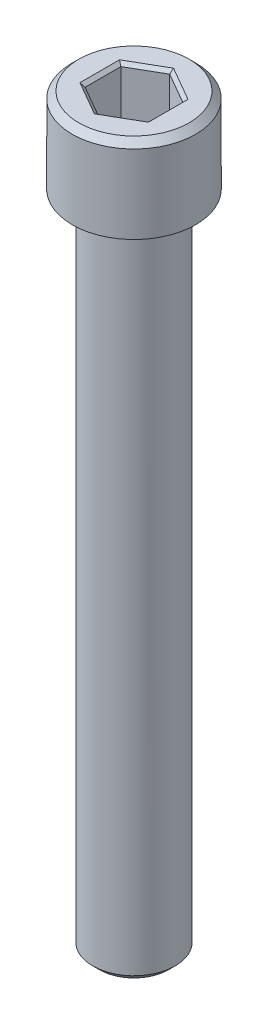
ISO-10303-21;
HEADER;
FILE_DESCRIPTION(('STEP AP214'),'2;1');
FILE_NAME('part.step','',(''),(''),'','','');
FILE_SCHEMA(('AUTOMOTIVE_DESIGN { 1 0 10303 214 1 1 1 1 }'));
ENDSEC;
DATA;
#1=APPLICATION_CONTEXT('core data for automotive mechanical design processes');
#2=APPLICATION_PROTOCOL_DEFINITION('international standard','automotive_design',2000,#1);
#3=PRODUCT_CONTEXT('',#1,'mechanical');
#4=PRODUCT('Part','Part','',(#3));
#5=PRODUCT_RELATED_PRODUCT_CATEGORY('part','',(#4));
#6=PRODUCT_DEFINITION_FORMATION('','',#4);
#7=PRODUCT_DEFINITION_CONTEXT('part definition',#1,'design');
#8=PRODUCT_DEFINITION('design','',#6,#7);
#9=PRODUCT_DEFINITION_SHAPE('','',#8);
#10=(LENGTH_UNIT() NAMED_UNIT(*) SI_UNIT(.MILLI.,.METRE.));
#11=(NAMED_UNIT(*) PLANE_ANGLE_UNIT() SI_UNIT($,.RADIAN.));
#12=(NAMED_UNIT(*) SI_UNIT($,.STERADIAN.) SOLID_ANGLE_UNIT());
#13=UNCERTAINTY_MEASURE_WITH_UNIT(LENGTH_MEASURE(1.E-05),#10,'distance_accuracy_value','');
#14=(GEOMETRIC_REPRESENTATION_CONTEXT(3) GLOBAL_UNCERTAINTY_ASSIGNED_CONTEXT((#13)) GLOBAL_UNIT_ASSIGNED_CONTEXT((#10,
#11,#12)) REPRESENTATION_CONTEXT('',''));
#15=CARTESIAN_POINT('',(0.,0.,0.));
#16=DIRECTION('',(0.,0.,1.));
#17=DIRECTION('',(1.,0.,0.));
#18=AXIS2_PLACEMENT_3D('',#15,#16,#17);
#19=CARTESIAN_POINT('',(0.,-4.57199999987097,0.));
#20=DIRECTION('',(0.,-1.,0.));
#21=DIRECTION('',(0.,0.,-1.));
#22=AXIS2_PLACEMENT_3D('',#19,#20,#21);
#23=PLANE('',#22);
#24=DIRECTION('',(-0.866025403798195,0.,0.499999999976173));
#25=VECTOR('',#24,1.);
#26=CARTESIAN_POINT('',(1.19380000002816,-4.572,2.06772225425588));
#27=LINE('',#26,#25);
#28=CARTESIAN_POINT('',(0.,-4.57199999993548,2.75696300537009));
#29=VERTEX_POINT('',#28);
#30=CARTESIAN_POINT('',(2.38759999998049,-4.57199999993548,1.37848150275658));
#31=VERTEX_POINT('',#30);
#32=EDGE_CURVE('E187',#29,#31,#27,.F.);
#33=ORIENTED_EDGE('',*,*,#32,.T.);
#34=DIRECTION('',(0.,0.,1.));
#35=VECTOR('',#34,1.);
#36=CARTESIAN_POINT('',(2.38760000028387,-4.572,0.));
#37=LINE('',#36,#35);
#38=CARTESIAN_POINT('',(2.38759999990537,-4.57199999993548,-1.37848150291712));
#39=VERTEX_POINT('',#38);
#40=EDGE_CURVE('E104',#31,#39,#37,.F.);
#41=ORIENTED_EDGE('',*,*,#40,.T.);
#42=DIRECTION('',(0.866025403798195,0.,0.499999999976173));
#43=VECTOR('',#42,1.);
#44=CARTESIAN_POINT('',(1.19380000002816,-4.572,-2.06772225425588));
#45=LINE('',#44,#43);
#46=CARTESIAN_POINT('',(-1.09766188326745E-10,-4.57199999993548,-2.75696300537009));
#47=VERTEX_POINT('',#46);
#48=EDGE_CURVE('E100',#39,#47,#45,.F.);
#49=ORIENTED_EDGE('',*,*,#48,.T.);
#50=DIRECTION('',(0.866025403798195,0.,-0.499999999976173));
#51=VECTOR('',#50,1.);
#52=CARTESIAN_POINT('',(-1.19380000002816,-4.572,-2.06772225425588));
#53=LINE('',#52,#51);
#54=CARTESIAN_POINT('',(-2.38759999998049,-4.57199999993548,-1.37848150275658));
#55=VERTEX_POINT('',#54);
#56=EDGE_CURVE('E91',#47,#55,#53,.F.);
#57=ORIENTED_EDGE('',*,*,#56,.T.);
#58=DIRECTION('',(0.,0.,-1.));
#59=VECTOR('',#58,1.);
#60=CARTESIAN_POINT('',(-2.38760000028387,-4.572,0.));
#61=LINE('',#60,#59);
#62=CARTESIAN_POINT('',(-2.38759999990537,-4.57199999993548,1.37848150291712));
#63=VERTEX_POINT('',#62);
#64=EDGE_CURVE('E86',#55,#63,#61,.F.);
#65=ORIENTED_EDGE('',*,*,#64,.T.);
#66=DIRECTION('',(-0.866025403798195,0.,-0.499999999976173));
#67=VECTOR('',#66,1.);
#68=CARTESIAN_POINT('',(-1.19380000002816,-4.572,2.06772225425588));
#69=LINE('',#68,#67);
#70=EDGE_CURVE('E191',#63,#29,#69,.F.);
#71=ORIENTED_EDGE('',*,*,#70,.T.);
#72=EDGE_LOOP('',(#33,#41,#49,#57,#65,#71));
#73=FACE_BOUND('',#72,.T.);
#74=ADVANCED_FACE('F17',(#73),#23,.F.);
#75=CARTESIAN_POINT('',(1.19380000002816,0.,-2.06772225425588));
#76=DIRECTION('',(-0.499999999976173,0.,0.866025403798195));
#77=DIRECTION('',(0.866025403798195,0.,0.499999999976173));
#78=AXIS2_PLACEMENT_3D('',#75,#76,#77);
#79=PLANE('',#78);
#80=DIRECTION('',(-0.866025403771631,-1.12605364376169E-10,-0.500000000022183));
#81=VECTOR('',#80,1.);
#82=CARTESIAN_POINT('',(2.38759999971589,-0.25399999993977,-1.37848150282184));
#83=LINE('',#82,#81);
#84=CARTESIAN_POINT('',(2.38759999998106,-0.254000000015281,-1.37848150296289));
#85=VERTEX_POINT('',#84);
#86=CARTESIAN_POINT('',(-4.77588435349632E-12,-0.254000000085992,-2.75696300551199));
#87=VERTEX_POINT('',#86);
#88=EDGE_CURVE('E110',#85,#87,#83,.T.);
#89=ORIENTED_EDGE('',*,*,#88,.T.);
#90=DIRECTION('',(0.,1.,0.));
#91=VECTOR('',#90,1.);
#92=CARTESIAN_POINT('',(-2.44303709207028E-10,0.,-2.75696300544587));
#93=LINE('',#92,#91);
#94=EDGE_CURVE('E96',#87,#47,#93,.F.);
#95=ORIENTED_EDGE('',*,*,#94,.T.);
#96=ORIENTED_EDGE('',*,*,#48,.F.);
#97=DIRECTION('',(0.,1.,0.));
#98=VECTOR('',#97,1.);
#99=CARTESIAN_POINT('',(2.38760000028387,0.,-1.378481502874));
#100=LINE('',#99,#98);
#101=EDGE_CURVE('E181',#39,#85,#100,.T.);
#102=ORIENTED_EDGE('',*,*,#101,.T.);
#103=EDGE_LOOP('',(#89,#95,#96,#102));
#104=FACE_BOUND('',#103,.T.);
#105=ADVANCED_FACE('F109',(#104),#79,.T.);
#106=CARTESIAN_POINT('',(-1.19380000002816,0.,-2.06772225425588));
#107=DIRECTION('',(0.499999999976173,0.,0.866025403798195));
#108=DIRECTION('',(0.866025403798195,0.,-0.499999999976173));
#109=AXIS2_PLACEMENT_3D('',#106,#107,#108);
#110=PLANE('',#109);
#111=DIRECTION('',(-0.866025403751825,7.29934061873727E-11,0.500000000056488));
#112=VECTOR('',#111,1.);
#113=CARTESIAN_POINT('',(-2.19194454254001E-10,-0.254000000187495,-2.75696300540238));
#114=LINE('',#113,#112);
#115=CARTESIAN_POINT('',(-2.38760000016596,-0.254000000021092,-1.37848150274502));
#116=VERTEX_POINT('',#115);
#117=EDGE_CURVE('E172',#87,#116,#114,.T.);
#118=ORIENTED_EDGE('',*,*,#117,.T.);
#119=DIRECTION('',(0.,1.,0.));
#120=VECTOR('',#119,1.);
#121=CARTESIAN_POINT('',(-2.38760000028387,0.,-1.37848150262));
#122=LINE('',#121,#120);
#123=EDGE_CURVE('E98',#116,#55,#122,.F.);
#124=ORIENTED_EDGE('',*,*,#123,.T.);
#125=ORIENTED_EDGE('',*,*,#56,.F.);
#126=ORIENTED_EDGE('',*,*,#94,.F.);
#127=EDGE_LOOP('',(#118,#124,#125,#126));
#128=FACE_BOUND('',#127,.T.);
#129=ADVANCED_FACE('F94',(#128),#110,.T.);
#130=CARTESIAN_POINT('',(-2.38760000028387,0.,0.));
#131=DIRECTION('',(1.,0.,0.));
#132=DIRECTION('',(0.,0.,-1.));
#133=AXIS2_PLACEMENT_3D('',#130,#131,#132);
#134=PLANE('',#133);
#135=DIRECTION('',(0.,0.,1.));
#136=VECTOR('',#135,1.);
#137=CARTESIAN_POINT('',(-2.38760000018248,-0.254000000182478,0.));
#138=LINE('',#137,#136);
#139=CARTESIAN_POINT('',(-2.38760000009063,-0.254000000015281,1.37848150291977));
#140=VERTEX_POINT('',#139);
#141=EDGE_CURVE('E169',#116,#140,#138,.T.);
#142=ORIENTED_EDGE('',*,*,#141,.T.);
#143=DIRECTION('',(0.,1.,0.));
#144=VECTOR('',#143,1.);
#145=CARTESIAN_POINT('',(-2.38759999984559,0.,1.3784815030465));
#146=LINE('',#145,#144);
#147=EDGE_CURVE('E189',#140,#63,#146,.F.);
#148=ORIENTED_EDGE('',*,*,#147,.T.);
#149=ORIENTED_EDGE('',*,*,#64,.F.);
#150=ORIENTED_EDGE('',*,*,#123,.F.);
#151=EDGE_LOOP('',(#142,#148,#149,#150));
#152=FACE_BOUND('',#151,.T.);
#153=ADVANCED_FACE('F217',(#152),#134,.T.);
#154=CARTESIAN_POINT('',(-1.19380000002816,0.,2.06772225425588));
#155=DIRECTION('',(0.499999999976173,0.,-0.866025403798195));
#156=DIRECTION('',(-0.866025403798195,0.,-0.499999999976173));
#157=AXIS2_PLACEMENT_3D('',#154,#155,#156);
#158=PLANE('',#157);
#159=DIRECTION('',(0.866025403765944,-1.01229897824031E-10,0.500000000032035));
#160=VECTOR('',#159,1.);
#161=CARTESIAN_POINT('',(-2.38759999971589,-0.25399999993977,1.37848150282184));
#162=LINE('',#161,#160);
#163=CARTESIAN_POINT('',(-8.14689911288454E-11,-0.254000000082071,2.75696300548031));
#164=VERTEX_POINT('',#163);
#165=EDGE_CURVE('E163',#140,#164,#162,.T.);
#166=ORIENTED_EDGE('',*,*,#165,.T.);
#167=DIRECTION('',(0.,1.,0.));
#168=VECTOR('',#167,1.);
#169=CARTESIAN_POINT('',(1.50218162561777E-10,0.,2.75696300550019));
#170=LINE('',#169,#168);
#171=EDGE_CURVE('E184',#164,#29,#170,.F.);
#172=ORIENTED_EDGE('',*,*,#171,.T.);
#173=ORIENTED_EDGE('',*,*,#70,.F.);
#174=ORIENTED_EDGE('',*,*,#147,.F.);
#175=EDGE_LOOP('',(#166,#172,#173,#174));
#176=FACE_BOUND('',#175,.T.);
#177=ADVANCED_FACE('F194',(#176),#158,.T.);
#178=CARTESIAN_POINT('',(1.19380000002816,0.,2.06772225425588));
#179=DIRECTION('',(-0.499999999976173,0.,-0.866025403798195));
#180=DIRECTION('',(-0.866025403798195,0.,0.499999999976173));
#181=AXIS2_PLACEMENT_3D('',#178,#179,#180);
#182=PLANE('',#181);
#183=DIRECTION('',(0.866025403757513,8.43688137506995E-11,-0.500000000046637));
#184=VECTOR('',#183,1.);
#185=CARTESIAN_POINT('',(1.0942820000831E-10,-0.254000000218857,2.75696300542954));
#186=LINE('',#185,#184);
#187=CARTESIAN_POINT('',(2.38760000012961,-0.254000000019374,1.37848150274353));
#188=VERTEX_POINT('',#187);
#189=EDGE_CURVE('E154',#164,#188,#186,.T.);
#190=ORIENTED_EDGE('',*,*,#189,.T.);
#191=DIRECTION('',(0.,1.,0.));
#192=VECTOR('',#191,1.);
#193=CARTESIAN_POINT('',(2.38760000028387,0.,1.37848150262));
#194=LINE('',#193,#192);
#195=EDGE_CURVE('E178',#188,#31,#194,.F.);
#196=ORIENTED_EDGE('',*,*,#195,.T.);
#197=ORIENTED_EDGE('',*,*,#32,.F.);
#198=ORIENTED_EDGE('',*,*,#171,.F.);
#199=EDGE_LOOP('',(#190,#196,#197,#198));
#200=FACE_BOUND('',#199,.T.);
#201=ADVANCED_FACE('F198',(#200),#182,.T.);
#202=CARTESIAN_POINT('',(2.38760000028387,0.,0.));
#203=DIRECTION('',(-1.,0.,0.));
#204=DIRECTION('',(0.,0.,1.));
#205=AXIS2_PLACEMENT_3D('',#202,#203,#204);
#206=PLANE('',#205);
#207=DIRECTION('',(0.,0.,1.));
#208=VECTOR('',#207,1.);
#209=CARTESIAN_POINT('',(2.38760000018248,-0.254000000182478,0.));
#210=LINE('',#209,#208);
#211=EDGE_CURVE('E150',#188,#85,#210,.F.);
#212=ORIENTED_EDGE('',*,*,#211,.T.);
#213=ORIENTED_EDGE('',*,*,#101,.F.);
#214=ORIENTED_EDGE('',*,*,#40,.F.);
#215=ORIENTED_EDGE('',*,*,#195,.F.);
#216=EDGE_LOOP('',(#212,#213,#214,#215));
#217=FACE_BOUND('',#216,.T.);
#218=ADVANCED_FACE('F200',(#217),#206,.T.);
#219=CARTESIAN_POINT('',(0.660400000249342,-1.32080000002424,-1.14384635338524));
#220=DIRECTION('',(0.353553390699095,-0.70710678114419,-0.612372435683609));
#221=DIRECTION('',(0.,0.654653670722942,-0.755928946005494));
#222=AXIS2_PLACEMENT_3D('',#219,#220,#221);
#223=PLANE('',#222);
#224=ORIENTED_EDGE('',*,*,#88,.F.);
#225=DIRECTION('',(0.654653671109424,0.654653671109424,-0.377964471618574));
#226=VECTOR('',#225,1.);
#227=CARTESIAN_POINT('',(2.38760000005548,-0.254000000309479,-1.378481502874));
#228=LINE('',#227,#226);
#229=CARTESIAN_POINT('',(2.64160000006856,-9.1492765380182E-11,-1.52512847073173));
#230=VERTEX_POINT('',#229);
#231=EDGE_CURVE('E147',#85,#230,#228,.T.);
#232=ORIENTED_EDGE('',*,*,#231,.T.);
#233=DIRECTION('',(-0.866025403696895,0.,-0.500000000151631));
#234=VECTOR('',#233,1.);
#235=CARTESIAN_POINT('',(2.6416,0.,-1.525128470692));
#236=LINE('',#235,#234);
#237=CARTESIAN_POINT('',(-4.60875241129692E-12,-2.663840692074E-11,-3.05025694242829));
#238=VERTEX_POINT('',#237);
#239=EDGE_CURVE('E144',#230,#238,#236,.T.);
#240=ORIENTED_EDGE('',*,*,#239,.T.);
#241=DIRECTION('',(0.,0.654653670722942,-0.755928946005494));
#242=VECTOR('',#241,1.);
#243=CARTESIAN_POINT('',(-1.77587979044436E-11,-1.50948571443743,-1.30725297540481));
#244=LINE('',#243,#242);
#245=EDGE_CURVE('E174',#238,#87,#244,.F.);
#246=ORIENTED_EDGE('',*,*,#245,.T.);
#247=EDGE_LOOP('',(#224,#232,#240,#246));
#248=FACE_BOUND('',#247,.T.);
#249=ADVANCED_FACE('F204',(#248),#223,.F.);
#250=CARTESIAN_POINT('',(-0.660400000249342,-1.32080000002424,-1.14384635338524));
#251=DIRECTION('',(-0.353553390699095,-0.70710678114419,-0.612372435683609));
#252=DIRECTION('',(0.,0.654653670722942,-0.755928946005494));
#253=AXIS2_PLACEMENT_3D('',#250,#251,#252);
#254=PLANE('',#253);
#255=ORIENTED_EDGE('',*,*,#117,.F.);
#256=ORIENTED_EDGE('',*,*,#245,.F.);
#257=DIRECTION('',(-0.866025403696895,0.,0.500000000151631));
#258=VECTOR('',#257,1.);
#259=CARTESIAN_POINT('',(0.,0.,-3.0502569424));
#260=LINE('',#259,#258);
#261=CARTESIAN_POINT('',(-2.64160000006856,-9.1492765449684E-11,-1.52512847073173));
#262=VERTEX_POINT('',#261);
#263=EDGE_CURVE('E141',#238,#262,#260,.T.);
#264=ORIENTED_EDGE('',*,*,#263,.T.);
#265=DIRECTION('',(0.654653670900678,-0.654653670900678,0.377964472341692));
#266=VECTOR('',#265,1.);
#267=CARTESIAN_POINT('',(-2.64160000018248,-1.82478815044518E-10,-1.525128470692));
#268=LINE('',#267,#266);
#269=EDGE_CURVE('E166',#262,#116,#268,.T.);
#270=ORIENTED_EDGE('',*,*,#269,.T.);
#271=EDGE_LOOP('',(#255,#256,#264,#270));
#272=FACE_BOUND('',#271,.T.);
#273=ADVANCED_FACE('F207',(#272),#254,.F.);
#274=CARTESIAN_POINT('',(-1.32080000018248,-1.32080000018248,0.));
#275=DIRECTION('',(-0.707106781186548,-0.707106781186548,0.));
#276=DIRECTION('',(0.707106781186548,-0.707106781186548,0.));
#277=AXIS2_PLACEMENT_3D('',#274,#275,#276);
#278=PLANE('',#277);
#279=DIRECTION('',(0.,0.,1.));
#280=VECTOR('',#279,1.);
#281=CARTESIAN_POINT('',(-2.6416,0.,0.));
#282=LINE('',#281,#280);
#283=CARTESIAN_POINT('',(-2.64160000010271,-1.1417592816739E-10,1.52512847071186));
#284=VERTEX_POINT('',#283);
#285=EDGE_CURVE('E138',#262,#284,#282,.T.);
#286=ORIENTED_EDGE('',*,*,#285,.T.);
#287=DIRECTION('',(0.654653671632602,-0.654653670390397,-0.377964471957796));
#288=VECTOR('',#287,1.);
#289=CARTESIAN_POINT('',(-2.64160000004587,-9.17461636176786E-11,1.52512847077145));
#290=LINE('',#289,#288);
#291=EDGE_CURVE('E160',#284,#140,#290,.T.);
#292=ORIENTED_EDGE('',*,*,#291,.T.);
#293=ORIENTED_EDGE('',*,*,#141,.F.);
#294=ORIENTED_EDGE('',*,*,#269,.F.);
#295=EDGE_LOOP('',(#286,#292,#293,#294));
#296=FACE_BOUND('',#295,.T.);
#297=ADVANCED_FACE('F215',(#296),#278,.F.);
#298=CARTESIAN_POINT('',(-0.660400000249342,-1.32080000002424,1.14384635338524));
#299=DIRECTION('',(-0.353553390699095,-0.70710678114419,0.612372435683609));
#300=DIRECTION('',(0.,-0.654653670722942,-0.755928946005494));
#301=AXIS2_PLACEMENT_3D('',#298,#299,#300);
#302=PLANE('',#301);
#303=DIRECTION('',(0.866025403696895,0.,0.500000000151631));
#304=VECTOR('',#303,1.);
#305=CARTESIAN_POINT('',(-2.6416,0.,1.525128470692));
#306=LINE('',#305,#304);
#307=CARTESIAN_POINT('',(-5.0274312880534E-11,-2.66383527112155E-11,3.05025694239661));
#308=VERTEX_POINT('',#307);
#309=EDGE_CURVE('E135',#284,#308,#306,.T.);
#310=ORIENTED_EDGE('',*,*,#309,.T.);
#311=DIRECTION('',(0.,-0.654653670722942,-0.755928946005494));
#312=VECTOR('',#311,1.);
#313=CARTESIAN_POINT('',(1.77587979044436E-11,-1.50948571443743,1.30725297540481));
#314=LINE('',#313,#312);
#315=EDGE_CURVE('E157',#308,#164,#314,.T.);
#316=ORIENTED_EDGE('',*,*,#315,.T.);
#317=ORIENTED_EDGE('',*,*,#165,.F.);
#318=ORIENTED_EDGE('',*,*,#291,.F.);
#319=EDGE_LOOP('',(#310,#316,#317,#318));
#320=FACE_BOUND('',#319,.T.);
#321=ADVANCED_FACE('F219',(#320),#302,.F.);
#322=CARTESIAN_POINT('',(0.660400000249342,-1.32080000002424,1.14384635338524));
#323=DIRECTION('',(0.353553390699095,-0.70710678114419,0.612372435683609));
#324=DIRECTION('',(0.,-0.654653670722942,-0.755928946005494));
#325=AXIS2_PLACEMENT_3D('',#322,#323,#324);
#326=PLANE('',#325);
#327=ORIENTED_EDGE('',*,*,#189,.F.);
#328=ORIENTED_EDGE('',*,*,#315,.F.);
#329=DIRECTION('',(0.866025403696895,0.,-0.500000000151631));
#330=VECTOR('',#329,1.);
#331=CARTESIAN_POINT('',(0.,0.,3.0502569424));
#332=LINE('',#331,#330);
#333=CARTESIAN_POINT('',(2.64160000006856,-9.1492765449684E-11,1.52512847073173));
#334=VERTEX_POINT('',#333);
#335=EDGE_CURVE('E132',#308,#334,#332,.T.);
#336=ORIENTED_EDGE('',*,*,#335,.T.);
#337=DIRECTION('',(-0.654653670900678,-0.654653670900678,-0.377964472341692));
#338=VECTOR('',#337,1.);
#339=CARTESIAN_POINT('',(2.64160000018248,-1.82478815044518E-10,1.525128470692));
#340=LINE('',#339,#338);
#341=EDGE_CURVE('E35',#334,#188,#340,.T.);
#342=ORIENTED_EDGE('',*,*,#341,.T.);
#343=EDGE_LOOP('',(#327,#328,#336,#342));
#344=FACE_BOUND('',#343,.T.);
#345=ADVANCED_FACE('F221',(#344),#326,.F.);
#346=CARTESIAN_POINT('',(1.32080000018248,-1.32080000018248,0.));
#347=DIRECTION('',(0.707106781186548,-0.707106781186548,0.));
#348=DIRECTION('',(0.707106781186548,0.707106781186548,0.));
#349=AXIS2_PLACEMENT_3D('',#346,#347,#348);
#350=PLANE('',#349);
#351=ORIENTED_EDGE('',*,*,#211,.F.);
#352=ORIENTED_EDGE('',*,*,#341,.F.);
#353=DIRECTION('',(0.,0.,1.));
#354=VECTOR('',#353,1.);
#355=CARTESIAN_POINT('',(2.6416,0.,0.));
#356=LINE('',#355,#354);
#357=EDGE_CURVE('E128',#334,#230,#356,.F.);
#358=ORIENTED_EDGE('',*,*,#357,.T.);
#359=ORIENTED_EDGE('',*,*,#231,.F.);
#360=EDGE_LOOP('',(#351,#352,#358,#359));
#361=FACE_BOUND('',#360,.T.);
#362=ADVANCED_FACE('F202',(#361),#350,.F.);
#363=CARTESIAN_POINT('',(0.,0.,0.));
#364=DIRECTION('',(0.,1.,0.));
#365=DIRECTION('',(0.,0.,1.));
#366=AXIS2_PLACEMENT_3D('',#363,#364,#365);
#367=PLANE('',#366);
#368=ORIENTED_EDGE('',*,*,#335,.F.);
#369=ORIENTED_EDGE('',*,*,#309,.F.);
#370=ORIENTED_EDGE('',*,*,#285,.F.);
#371=ORIENTED_EDGE('',*,*,#263,.F.);
#372=ORIENTED_EDGE('',*,*,#239,.F.);
#373=ORIENTED_EDGE('',*,*,#357,.F.);
#374=EDGE_LOOP('',(#368,#369,#370,#371,#372,#373));
#375=FACE_BOUND('',#374,.T.);
#376=CARTESIAN_POINT('',(0.,0.,0.));
#377=DIRECTION('',(0.,-1.,0.));
#378=DIRECTION('',(0.,0.,-1.));
#379=AXIS2_PLACEMENT_3D('',#376,#377,#378);
#380=CIRCLE('',#379,4.2545);
#381=CARTESIAN_POINT('',(0.,0.,-4.2545));
#382=VERTEX_POINT('',#381);
#383=EDGE_CURVE('E20',#382,#382,#380,.F.);
#384=ORIENTED_EDGE('',*,*,#383,.T.);
#385=EDGE_LOOP('',(#384));
#386=FACE_BOUND('',#385,.T.);
#387=ADVANCED_FACE('F211',(#375,#386),#367,.T.);
#388=CARTESIAN_POINT('',(0.,0.,0.));
#389=DIRECTION('',(0.,-1.,0.));
#390=DIRECTION('',(0.,0.,-1.));
#391=AXIS2_PLACEMENT_3D('',#388,#389,#390);
#392=CONICAL_SURFACE('',#391,4.2545,0.785398163397448);
#393=CARTESIAN_POINT('',(0.,-0.508000000508001,0.));
#394=DIRECTION('',(0.,1.,0.));
#395=DIRECTION('',(0.,0.,1.));
#396=AXIS2_PLACEMENT_3D('',#393,#394,#395);
#397=CIRCLE('',#396,4.7625);
#398=CARTESIAN_POINT('',(0.,-0.508000000508,4.7625));
#399=VERTEX_POINT('',#398);
#400=EDGE_CURVE('E120',#399,#399,#397,.T.);
#401=ORIENTED_EDGE('',*,*,#400,.T.);
#402=EDGE_LOOP('',(#401));
#403=FACE_BOUND('',#402,.T.);
#404=ORIENTED_EDGE('',*,*,#383,.F.);
#405=EDGE_LOOP('',(#404));
#406=FACE_BOUND('',#405,.T.);
#407=ADVANCED_FACE('F255',(#403,#406),#392,.T.);
#408=CARTESIAN_POINT('',(0.,-6.5532,0.));
#409=DIRECTION('',(0.,1.,0.));
#410=DIRECTION('',(0.,0.,1.));
#411=AXIS2_PLACEMENT_3D('',#408,#409,#410);
#412=CYLINDRICAL_SURFACE('',#411,4.7625);
#413=ORIENTED_EDGE('',*,*,#400,.F.);
#414=EDGE_LOOP('',(#413));
#415=FACE_BOUND('',#414,.T.);
#416=CARTESIAN_POINT('',(0.,-6.5532,0.));
#417=DIRECTION('',(0.,1.,0.));
#418=DIRECTION('',(0.,0.,1.));
#419=AXIS2_PLACEMENT_3D('',#416,#417,#418);
#420=CIRCLE('',#419,4.7625);
#421=CARTESIAN_POINT('',(0.,-6.5532,4.7625));
#422=VERTEX_POINT('',#421);
#423=EDGE_CURVE('E118',#422,#422,#420,.T.);
#424=ORIENTED_EDGE('',*,*,#423,.T.);
#425=EDGE_LOOP('',(#424));
#426=FACE_BOUND('',#425,.T.);
#427=ADVANCED_FACE('F251',(#415,#426),#412,.T.);
#428=CARTESIAN_POINT('',(0.,-6.55319999682581,0.));
#429=DIRECTION('',(0.,1.,0.));
#430=DIRECTION('',(0.,0.,1.));
#431=AXIS2_PLACEMENT_3D('',#428,#429,#430);
#432=PLANE('',#431);
#433=CARTESIAN_POINT('',(0.,-6.5532,0.));
#434=DIRECTION('',(0.,1.,0.));
#435=DIRECTION('',(-1.,0.,0.));
#436=AXIS2_PLACEMENT_3D('',#433,#434,#435);
#437=CIRCLE('',#436,3.175);
#438=CARTESIAN_POINT('',(-3.17500000000006,-6.55320000000001,0.));
#439=VERTEX_POINT('',#438);
#440=EDGE_CURVE('E116',#439,#439,#437,.T.);
#441=ORIENTED_EDGE('',*,*,#440,.T.);
#442=EDGE_LOOP('',(#441));
#443=FACE_BOUND('',#442,.T.);
#444=ORIENTED_EDGE('',*,*,#423,.F.);
#445=EDGE_LOOP('',(#444));
#446=FACE_BOUND('',#445,.T.);
#447=ADVANCED_FACE('F247',(#443,#446),#432,.F.);
#448=CARTESIAN_POINT('',(0.,-56.8452,0.));
#449=DIRECTION('',(0.,1.,0.));
#450=DIRECTION('',(-1.,0.,0.));
#451=AXIS2_PLACEMENT_3D('',#448,#449,#450);
#452=CYLINDRICAL_SURFACE('',#451,3.175);
#453=ORIENTED_EDGE('',*,*,#440,.F.);
#454=EDGE_LOOP('',(#453));
#455=FACE_BOUND('',#454,.T.);
#456=CARTESIAN_POINT('',(0.,-56.8452,0.));
#457=DIRECTION('',(0.,1.,0.));
#458=DIRECTION('',(0.,0.,1.));
#459=AXIS2_PLACEMENT_3D('',#456,#457,#458);
#460=CIRCLE('',#459,3.175);
#461=CARTESIAN_POINT('',(0.,-56.8452,3.175));
#462=VERTEX_POINT('',#461);
#463=EDGE_CURVE('E26',#462,#462,#460,.T.);
#464=ORIENTED_EDGE('',*,*,#463,.T.);
#465=EDGE_LOOP('',(#464));
#466=FACE_BOUND('',#465,.T.);
#467=ADVANCED_FACE('F239',(#455,#466),#452,.T.);
#468=CARTESIAN_POINT('',(0.,-57.3531999968258,0.));
#469=DIRECTION('',(0.,1.,0.));
#470=DIRECTION('',(0.,0.,1.));
#471=AXIS2_PLACEMENT_3D('',#468,#469,#470);
#472=PLANE('',#471);
#473=CARTESIAN_POINT('',(0.,-57.3532,0.));
#474=DIRECTION('',(0.,1.,0.));
#475=DIRECTION('',(0.,0.,1.));
#476=AXIS2_PLACEMENT_3D('',#473,#474,#475);
#477=CIRCLE('',#476,2.667);
#478=CARTESIAN_POINT('',(0.,-57.3532,2.667));
#479=VERTEX_POINT('',#478);
#480=EDGE_CURVE('E11',#479,#479,#477,.F.);
#481=ORIENTED_EDGE('',*,*,#480,.T.);
#482=EDGE_LOOP('',(#481));
#483=FACE_BOUND('',#482,.T.);
#484=ADVANCED_FACE('F233',(#483),#472,.F.);
#485=CARTESIAN_POINT('',(0.,-57.3532,0.));
#486=DIRECTION('',(0.,1.,0.));
#487=DIRECTION('',(0.,0.,1.));
#488=AXIS2_PLACEMENT_3D('',#485,#486,#487);
#489=CONICAL_SURFACE('',#488,2.667,0.785398163397447);
#490=ORIENTED_EDGE('',*,*,#480,.F.);
#491=EDGE_LOOP('',(#490));
#492=FACE_BOUND('',#491,.T.);
#493=ORIENTED_EDGE('',*,*,#463,.F.);
#494=EDGE_LOOP('',(#493));
#495=FACE_BOUND('',#494,.T.);
#496=ADVANCED_FACE('F231',(#492,#495),#489,.T.);
#497=CLOSED_SHELL('',(#74,#105,#129,#153,#177,#201,#218,#249,#273,#297,#321,#345,#362,#387,#407,
#427,#447,#467,#484,#496));
#498=MANIFOLD_SOLID_BREP('B1',#497);
#499=ADVANCED_BREP_SHAPE_REPRESENTATION('',(#18,#498),#14);
#500=SHAPE_DEFINITION_REPRESENTATION(#9,#499);
ENDSEC;
END-ISO-10303-21;
